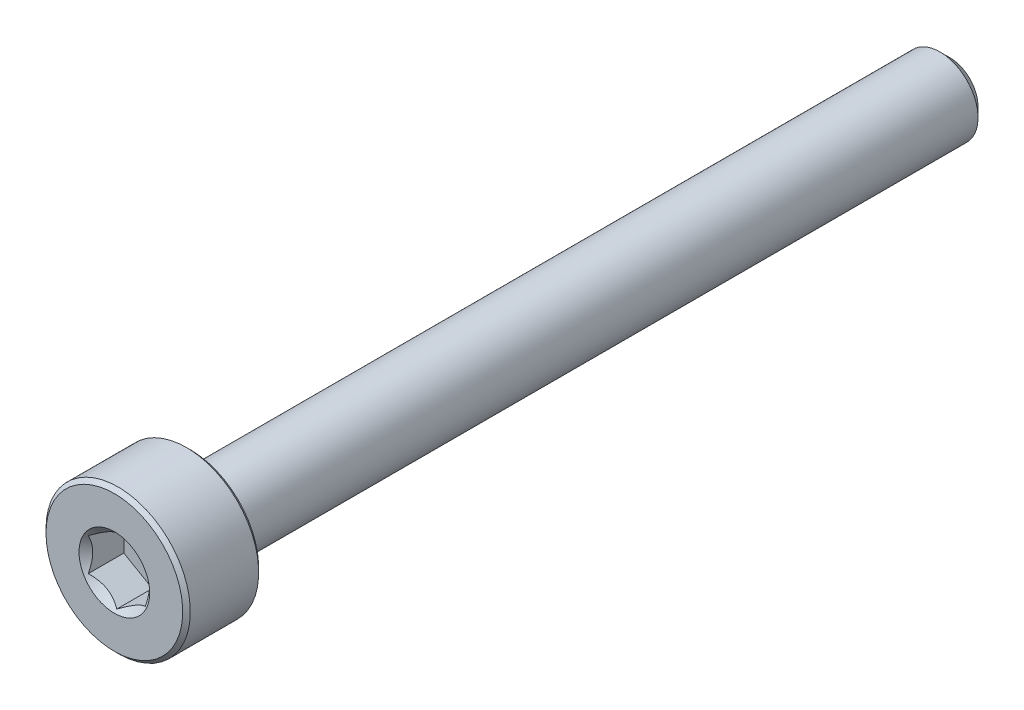
ISO-10303-21;
HEADER;
FILE_DESCRIPTION(('STEP AP214'),'2;1');
FILE_NAME('part.step','',(''),(''),'','','');
FILE_SCHEMA(('AUTOMOTIVE_DESIGN { 1 0 10303 214 1 1 1 1 }'));
ENDSEC;
DATA;
#1=APPLICATION_CONTEXT('core data for automotive mechanical design processes');
#2=APPLICATION_PROTOCOL_DEFINITION('international standard','automotive_design',2000,#1);
#3=PRODUCT_CONTEXT('',#1,'mechanical');
#4=PRODUCT('Part','Part','',(#3));
#5=PRODUCT_RELATED_PRODUCT_CATEGORY('part','',(#4));
#6=PRODUCT_DEFINITION_FORMATION('','',#4);
#7=PRODUCT_DEFINITION_CONTEXT('part definition',#1,'design');
#8=PRODUCT_DEFINITION('design','',#6,#7);
#9=PRODUCT_DEFINITION_SHAPE('','',#8);
#10=(LENGTH_UNIT() NAMED_UNIT(*) SI_UNIT(.MILLI.,.METRE.));
#11=(NAMED_UNIT(*) PLANE_ANGLE_UNIT() SI_UNIT($,.RADIAN.));
#12=(NAMED_UNIT(*) SI_UNIT($,.STERADIAN.) SOLID_ANGLE_UNIT());
#13=UNCERTAINTY_MEASURE_WITH_UNIT(LENGTH_MEASURE(1.E-05),#10,'distance_accuracy_value','');
#14=(GEOMETRIC_REPRESENTATION_CONTEXT(3) GLOBAL_UNCERTAINTY_ASSIGNED_CONTEXT((#13)) GLOBAL_UNIT_ASSIGNED_CONTEXT((#10,
#11,#12)) REPRESENTATION_CONTEXT('',''));
#15=CARTESIAN_POINT('',(0.,0.,0.));
#16=DIRECTION('',(0.,0.,1.));
#17=DIRECTION('',(1.,0.,0.));
#18=AXIS2_PLACEMENT_3D('',#15,#16,#17);
#19=CARTESIAN_POINT('',(0.,0.740192378864677,-11.));
#20=DIRECTION('',(0.,0.,-1.));
#21=DIRECTION('',(-1.,0.,0.));
#22=AXIS2_PLACEMENT_3D('',#19,#20,#21);
#23=PLANE('',#22);
#24=CARTESIAN_POINT('',(0.,0.,-11.));
#25=DIRECTION('',(0.,0.,-1.));
#26=DIRECTION('',(-1.,0.,0.));
#27=AXIS2_PLACEMENT_3D('',#24,#25,#26);
#28=CIRCLE('',#27,0.740192378864677);
#29=CARTESIAN_POINT('',(-0.740192378864677,0.,-11.));
#30=VERTEX_POINT('',#29);
#31=EDGE_CURVE('E57',#30,#30,#28,.T.);
#32=ORIENTED_EDGE('',*,*,#31,.T.);
#33=EDGE_LOOP('',(#32));
#34=FACE_BOUND('',#33,.T.);
#35=ADVANCED_FACE('F44',(#34),#23,.T.);
#36=CARTESIAN_POINT('',(0.,0.,-11.));
#37=DIRECTION('',(0.,0.,1.));
#38=DIRECTION('',(1.,0.,0.));
#39=AXIS2_PLACEMENT_3D('',#36,#37,#38);
#40=CONICAL_SURFACE('',#39,0.740192378864677,0.785398163397446);
#41=CARTESIAN_POINT('',(0.,0.,-10.7401923788647));
#42=DIRECTION('',(0.,0.,-1.));
#43=DIRECTION('',(-1.,0.,0.));
#44=AXIS2_PLACEMENT_3D('',#41,#42,#43);
#45=CIRCLE('',#44,1.);
#46=CARTESIAN_POINT('',(-1.,0.,-10.7401923788647));
#47=VERTEX_POINT('',#46);
#48=EDGE_CURVE('E160',#47,#47,#45,.T.);
#49=ORIENTED_EDGE('',*,*,#48,.T.);
#50=EDGE_LOOP('',(#49));
#51=FACE_BOUND('',#50,.T.);
#52=ORIENTED_EDGE('',*,*,#31,.F.);
#53=EDGE_LOOP('',(#52));
#54=FACE_BOUND('',#53,.T.);
#55=ADVANCED_FACE('F166',(#51,#54),#40,.T.);
#56=CARTESIAN_POINT('',(0.,0.,-11.));
#57=DIRECTION('',(0.,0.,-1.));
#58=DIRECTION('',(-1.,0.,0.));
#59=AXIS2_PLACEMENT_3D('',#56,#57,#58);
#60=CYLINDRICAL_SURFACE('',#59,1.);
#61=CARTESIAN_POINT('',(0.,0.,8.9));
#62=DIRECTION('',(0.,0.,-1.));
#63=DIRECTION('',(-1.,0.,0.));
#64=AXIS2_PLACEMENT_3D('',#61,#62,#63);
#65=CIRCLE('',#64,1.);
#66=CARTESIAN_POINT('',(-1.,0.,8.9));
#67=VERTEX_POINT('',#66);
#68=EDGE_CURVE('E157',#67,#67,#65,.T.);
#69=ORIENTED_EDGE('',*,*,#68,.T.);
#70=EDGE_LOOP('',(#69));
#71=FACE_BOUND('',#70,.T.);
#72=ORIENTED_EDGE('',*,*,#48,.F.);
#73=EDGE_LOOP('',(#72));
#74=FACE_BOUND('',#73,.T.);
#75=ADVANCED_FACE('F168',(#71,#74),#60,.T.);
#76=CARTESIAN_POINT('',(0.,0.,8.9));
#77=DIRECTION('',(0.,0.,-1.));
#78=DIRECTION('',(-1.,0.,0.));
#79=AXIS2_PLACEMENT_3D('',#76,#77,#78);
#80=TOROIDAL_SURFACE('',#79,1.1,0.0999999999999979);
#81=CARTESIAN_POINT('',(0.,0.,9.));
#82=DIRECTION('',(0.,0.,-1.));
#83=DIRECTION('',(-1.,0.,0.));
#84=AXIS2_PLACEMENT_3D('',#81,#82,#83);
#85=CIRCLE('',#84,1.1);
#86=CARTESIAN_POINT('',(-1.1,0.,9.));
#87=VERTEX_POINT('',#86);
#88=EDGE_CURVE('E154',#87,#87,#85,.T.);
#89=ORIENTED_EDGE('',*,*,#88,.T.);
#90=EDGE_LOOP('',(#89));
#91=FACE_BOUND('',#90,.T.);
#92=ORIENTED_EDGE('',*,*,#68,.F.);
#93=EDGE_LOOP('',(#92));
#94=FACE_BOUND('',#93,.T.);
#95=ADVANCED_FACE('F174',(#91,#94),#80,.F.);
#96=CARTESIAN_POINT('',(0.,1.8,9.));
#97=DIRECTION('',(0.,0.,-1.));
#98=DIRECTION('',(-1.,0.,0.));
#99=AXIS2_PLACEMENT_3D('',#96,#97,#98);
#100=PLANE('',#99);
#101=CARTESIAN_POINT('',(0.,0.,9.));
#102=DIRECTION('',(0.,0.,-1.));
#103=DIRECTION('',(-1.,0.,0.));
#104=AXIS2_PLACEMENT_3D('',#101,#102,#103);
#105=CIRCLE('',#104,1.8);
#106=CARTESIAN_POINT('',(-1.8,0.,9.));
#107=VERTEX_POINT('',#106);
#108=EDGE_CURVE('E151',#107,#107,#105,.T.);
#109=ORIENTED_EDGE('',*,*,#108,.T.);
#110=EDGE_LOOP('',(#109));
#111=FACE_BOUND('',#110,.T.);
#112=ORIENTED_EDGE('',*,*,#88,.F.);
#113=EDGE_LOOP('',(#112));
#114=FACE_BOUND('',#113,.T.);
#115=ADVANCED_FACE('F180',(#111,#114),#100,.T.);
#116=CARTESIAN_POINT('',(0.,0.,9.));
#117=DIRECTION('',(0.,0.,1.));
#118=DIRECTION('',(1.,0.,0.));
#119=AXIS2_PLACEMENT_3D('',#116,#117,#118);
#120=CONICAL_SURFACE('',#119,1.8,0.785398163397452);
#121=CARTESIAN_POINT('',(0.,0.,9.1));
#122=DIRECTION('',(0.,0.,-1.));
#123=DIRECTION('',(-1.,0.,0.));
#124=AXIS2_PLACEMENT_3D('',#121,#122,#123);
#125=CIRCLE('',#124,1.9);
#126=CARTESIAN_POINT('',(-1.9,0.,9.1));
#127=VERTEX_POINT('',#126);
#128=EDGE_CURVE('E148',#127,#127,#125,.T.);
#129=ORIENTED_EDGE('',*,*,#128,.T.);
#130=EDGE_LOOP('',(#129));
#131=FACE_BOUND('',#130,.T.);
#132=ORIENTED_EDGE('',*,*,#108,.F.);
#133=EDGE_LOOP('',(#132));
#134=FACE_BOUND('',#133,.T.);
#135=ADVANCED_FACE('F184',(#131,#134),#120,.T.);
#136=CARTESIAN_POINT('',(0.,0.,-11.));
#137=DIRECTION('',(0.,0.,-1.));
#138=DIRECTION('',(-1.,0.,0.));
#139=AXIS2_PLACEMENT_3D('',#136,#137,#138);
#140=CYLINDRICAL_SURFACE('',#139,1.9);
#141=CARTESIAN_POINT('',(0.,0.,10.9));
#142=DIRECTION('',(0.,0.,-1.));
#143=DIRECTION('',(-1.,0.,0.));
#144=AXIS2_PLACEMENT_3D('',#141,#142,#143);
#145=CIRCLE('',#144,1.9);
#146=CARTESIAN_POINT('',(-1.9,0.,10.9));
#147=VERTEX_POINT('',#146);
#148=EDGE_CURVE('E145',#147,#147,#145,.T.);
#149=ORIENTED_EDGE('',*,*,#148,.T.);
#150=EDGE_LOOP('',(#149));
#151=FACE_BOUND('',#150,.T.);
#152=ORIENTED_EDGE('',*,*,#128,.F.);
#153=EDGE_LOOP('',(#152));
#154=FACE_BOUND('',#153,.T.);
#155=ADVANCED_FACE('F188',(#151,#154),#140,.T.);
#156=CARTESIAN_POINT('',(0.,0.,10.9));
#157=DIRECTION('',(0.,0.,-1.));
#158=DIRECTION('',(-1.,0.,0.));
#159=AXIS2_PLACEMENT_3D('',#156,#157,#158);
#160=CONICAL_SURFACE('',#159,1.9,0.785398163397452);
#161=CARTESIAN_POINT('',(0.,0.,11.));
#162=DIRECTION('',(0.,0.,-1.));
#163=DIRECTION('',(-1.,0.,0.));
#164=AXIS2_PLACEMENT_3D('',#161,#162,#163);
#165=CIRCLE('',#164,1.8);
#166=CARTESIAN_POINT('',(-1.8,0.,11.));
#167=VERTEX_POINT('',#166);
#168=EDGE_CURVE('E142',#167,#167,#165,.T.);
#169=ORIENTED_EDGE('',*,*,#168,.T.);
#170=EDGE_LOOP('',(#169));
#171=FACE_BOUND('',#170,.T.);
#172=ORIENTED_EDGE('',*,*,#148,.F.);
#173=EDGE_LOOP('',(#172));
#174=FACE_BOUND('',#173,.T.);
#175=ADVANCED_FACE('F192',(#171,#174),#160,.T.);
#176=CARTESIAN_POINT('',(0.,0.,11.));
#177=DIRECTION('',(0.,0.,1.));
#178=DIRECTION('',(1.,0.,0.));
#179=AXIS2_PLACEMENT_3D('',#176,#177,#178);
#180=PLANE('',#179);
#181=CARTESIAN_POINT('',(0.,0.,11.));
#182=DIRECTION('',(0.,0.,1.));
#183=DIRECTION('',(1.,0.,0.));
#184=AXIS2_PLACEMENT_3D('',#181,#182,#183);
#185=CIRCLE('',#184,0.930977309068267);
#186=CARTESIAN_POINT('',(0.930977309068267,0.,11.));
#187=VERTEX_POINT('',#186);
#188=EDGE_CURVE('E116',#187,#187,#185,.T.);
#189=ORIENTED_EDGE('',*,*,#188,.F.);
#190=EDGE_LOOP('',(#189));
#191=FACE_BOUND('',#190,.T.);
#192=ORIENTED_EDGE('',*,*,#168,.F.);
#193=EDGE_LOOP('',(#192));
#194=FACE_BOUND('',#193,.T.);
#195=ADVANCED_FACE('F196',(#191,#194),#180,.T.);
#196=CARTESIAN_POINT('',(0.,0.,11.));
#197=DIRECTION('',(0.,0.,1.));
#198=DIRECTION('',(1.,0.,0.));
#199=AXIS2_PLACEMENT_3D('',#196,#197,#198);
#200=CONICAL_SURFACE('',#199,0.930977309068267,0.78539816339745);
#201=ORIENTED_EDGE('',*,*,#188,.T.);
#202=EDGE_LOOP('',(#201));
#203=FACE_BOUND('',#202,.T.);
#204=CARTESIAN_POINT('',(-0.000200000000000882,-0.86614087383827,10.9351635878609));
#205=CARTESIAN_POINT('',(0.0255899625576808,-0.851251032013202,10.9202822051801));
#206=CARTESIAN_POINT('',(0.0518112021286585,-0.836112192288413,10.9062743603231));
#207=CARTESIAN_POINT('',(0.105279708235705,-0.805242135894342,10.8806256193984));
#208=CARTESIAN_POINT('',(0.132532067460572,-0.789507978959813,10.8689990064218));
#209=CARTESIAN_POINT('',(0.187485350381352,-0.757780686272647,10.8490821404884));
#210=CARTESIAN_POINT('',(0.215172256695508,-0.741795643459141,10.8407417887975));
#211=CARTESIAN_POINT('',(0.271155595130851,-0.709473647943362,10.8278908366776));
#212=CARTESIAN_POINT('',(0.299450314843643,-0.693137683900537,10.823370635305));
#213=CARTESIAN_POINT('',(0.348210289268841,-0.664986099540469,10.8192939278136));
#214=CARTESIAN_POINT('',(0.36861206565557,-0.653207128451645,10.8186908913302));
#215=CARTESIAN_POINT('',(0.409376134696357,-0.629671982217682,10.8197026007317));
#216=CARTESIAN_POINT('',(0.429738417651452,-0.617915812672242,10.8213178357062));
#217=CARTESIAN_POINT('',(0.49053454308682,-0.582815153286446,10.8293842416892));
#218=CARTESIAN_POINT('',(0.530665854996096,-0.559645329552693,10.8390570305439));
#219=CARTESIAN_POINT('',(0.601110400354023,-0.518974152327353,10.8624044126885));
#220=CARTESIAN_POINT('',(0.631753572009084,-0.50128230892348,10.8748566527884));
#221=CARTESIAN_POINT('',(0.691839345804789,-0.466591771248063,10.902907704947));
#222=CARTESIAN_POINT('',(0.72128548838159,-0.44959103290475,10.9184962806199));
#223=CARTESIAN_POINT('',(0.7502,-0.432897231838375,10.9351635878609));
#224=B_SPLINE_CURVE_WITH_KNOTS('',3,(#204,#205,#206,#207,#208,#209,#210,#211,#212,#213,#214,
#215,#216,#217,#218,#219,#220,#221,#222,#223),.UNSPECIFIED.,.F.,.F.,(4,2,2,2,2,2,2,2,2,4),(0.,
0.0999419466095594,0.200466857654445,0.299393763705716,0.398071297300228,0.468665775681745,
0.539275821398836,0.680536257244562,0.792918418368073,0.904939568716033),.UNSPECIFIED.);
#225=CARTESIAN_POINT('',(0.,-0.866025403784432,10.9350480947162));
#226=VERTEX_POINT('',#225);
#227=CARTESIAN_POINT('',(0.75,-0.433012701892213,10.9350480947162));
#228=VERTEX_POINT('',#227);
#229=EDGE_CURVE('E12',#226,#228,#224,.T.);
#230=ORIENTED_EDGE('',*,*,#229,.F.);
#231=CARTESIAN_POINT('',(-0.750199999999995,-0.43289723183838,10.9351635878609));
#232=CARTESIAN_POINT('',(-0.724410037442314,-0.447787073663448,10.9202822051801));
#233=CARTESIAN_POINT('',(-0.698188797871337,-0.462925913388237,10.9062743603231));
#234=CARTESIAN_POINT('',(-0.64472029176429,-0.493795969782308,10.8806256193984));
#235=CARTESIAN_POINT('',(-0.617467932539424,-0.509530126716837,10.8689990064218));
#236=CARTESIAN_POINT('',(-0.562514649618644,-0.541257419404002,10.8490821404884));
#237=CARTESIAN_POINT('',(-0.534827743304487,-0.557242462217508,10.8407417887975));
#238=CARTESIAN_POINT('',(-0.478844404869144,-0.589564457733288,10.8278908366776));
#239=CARTESIAN_POINT('',(-0.450549685156352,-0.605900421776113,10.823370635305));
#240=CARTESIAN_POINT('',(-0.401789710731154,-0.63405200613618,10.8192939278136));
#241=CARTESIAN_POINT('',(-0.381387934344425,-0.645830977225005,10.8186908913302));
#242=CARTESIAN_POINT('',(-0.340623865303637,-0.669366123458968,10.8197026007317));
#243=CARTESIAN_POINT('',(-0.320261582348543,-0.681122293004407,10.8213178357062));
#244=CARTESIAN_POINT('',(-0.259465456913174,-0.716222952390203,10.8293842416892));
#245=CARTESIAN_POINT('',(-0.219334145003899,-0.739392776123956,10.8390570305439));
#246=CARTESIAN_POINT('',(-0.148889599645973,-0.780063953349295,10.8624044126885));
#247=CARTESIAN_POINT('',(-0.118246427990913,-0.797755796753168,10.8748566527884));
#248=CARTESIAN_POINT('',(-0.0581606541952103,-0.832446334428584,10.902907704947));
#249=CARTESIAN_POINT('',(-0.0287145116184099,-0.849447072771895,10.9184962806199));
#250=CARTESIAN_POINT('',(0.000199999999998724,-0.86614087383827,10.9351635878609));
#251=B_SPLINE_CURVE_WITH_KNOTS('',3,(#231,#232,#233,#234,#235,#236,#237,#238,#239,#240,#241,
#242,#243,#244,#245,#246,#247,#248,#249,#250),.UNSPECIFIED.,.F.,.F.,(4,2,2,2,2,2,2,2,2,4),(0.,
0.0999419466095585,0.200466857654445,0.299393763705715,0.398071297300228,0.468665775681745,
0.539275821398836,0.680536257244562,0.792918418368068,0.904939568716024),.UNSPECIFIED.);
#252=CARTESIAN_POINT('',(-0.749999999999995,-0.433012701892218,10.9350480947162));
#253=VERTEX_POINT('',#252);
#254=EDGE_CURVE('E102',#253,#226,#251,.T.);
#255=ORIENTED_EDGE('',*,*,#254,.F.);
#256=CARTESIAN_POINT('',(-0.749999999999995,-0.9089931584245,11.2474829414547));
#257=CARTESIAN_POINT('',(-0.749999999999995,-0.887052399965032,11.2305616523291));
#258=CARTESIAN_POINT('',(-0.749999999999995,-0.86499445254444,11.2137927714218));
#259=CARTESIAN_POINT('',(-0.749999999999995,-0.820595091161565,11.180624057915));
#260=CARTESIAN_POINT('',(-0.749999999999995,-0.798253612413865,11.1642243121246));
#261=CARTESIAN_POINT('',(-0.749999999999995,-0.73040351594495,11.1154409498094));
#262=CARTESIAN_POINT('',(-0.749999999999995,-0.68440148609021,11.0837326305615));
#263=CARTESIAN_POINT('',(-0.749999999999995,-0.587630943752085,11.0210512707378));
#264=CARTESIAN_POINT('',(-0.749999999999995,-0.536746006676903,10.9902560400654));
#265=CARTESIAN_POINT('',(-0.749999999999995,-0.43238337645402,10.9336257718331));
#266=CARTESIAN_POINT('',(-0.749999999999995,-0.378915238071277,10.9077739815374));
#267=CARTESIAN_POINT('',(-0.749999999999996,-0.299071429351743,10.876137143555));
#268=CARTESIAN_POINT('',(-0.749999999999996,-0.273980510808171,10.8671385892067));
#269=CARTESIAN_POINT('',(-0.749999999999996,-0.223167896807673,10.8511461852722));
#270=CARTESIAN_POINT('',(-0.749999999999996,-0.197446161667869,10.8441524621572));
#271=CARTESIAN_POINT('',(-0.749999999999996,-0.120459338268896,10.8270275033935));
#272=CARTESIAN_POINT('',(-0.749999999999996,-0.0683464355179096,10.8203161345352));
#273=CARTESIAN_POINT('',(-0.749999999999996,0.0337920589257214,10.8181253211917));
#274=CARTESIAN_POINT('',(-0.749999999999996,0.0838066628456617,10.8221565412005));
#275=CARTESIAN_POINT('',(-0.749999999999996,0.157981834018414,10.835074885811));
#276=CARTESIAN_POINT('',(-0.749999999999996,0.182796003556083,10.8406123005046));
#277=CARTESIAN_POINT('',(-0.749999999999996,0.231887166565739,10.853698524901));
#278=CARTESIAN_POINT('',(-0.749999999999996,0.256164188491815,10.8612472277831));
#279=CARTESIAN_POINT('',(-0.749999999999996,0.330659225549256,10.8873056029569));
#280=CARTESIAN_POINT('',(-0.749999999999996,0.379861121085843,10.9087021269934));
#281=CARTESIAN_POINT('',(-0.749999999999996,0.475970605705222,10.9563197744089));
#282=CARTESIAN_POINT('',(-0.749999999999996,0.522869373813369,10.98255785461));
#283=CARTESIAN_POINT('',(-0.749999999999996,0.612520945812658,11.0367390817918));
#284=CARTESIAN_POINT('',(-0.749999999999996,0.655364174071619,11.0645345354766));
#285=CARTESIAN_POINT('',(-0.749999999999997,0.718484766813281,11.1075252259075));
#286=CARTESIAN_POINT('',(-0.749999999999997,0.739253587078311,11.1220113238788));
#287=CARTESIAN_POINT('',(-0.749999999999997,0.780506229689749,11.1513724151974));
#288=CARTESIAN_POINT('',(-0.749999999999997,0.800990128619761,11.1662473008223));
#289=CARTESIAN_POINT('',(-0.749999999999997,0.821355148585424,11.181283577643));
#290=B_SPLINE_CURVE_WITH_KNOTS('',3,(#256,#257,#258,#259,#260,#261,#262,#263,#264,#265,#266,
#267,#268,#269,#270,#271,#272,#273,#274,#275,#276,#277,#278,#279,#280,#281,#282,#283,#284,#285,
#286,#287,#288,#289),.UNSPECIFIED.,.F.,.F.,(4,2,2,2,2,2,2,2,2,2,2,2,2,2,2,2,4),(0.,
0.0831217081502298,0.166262763947898,0.333808791437732,0.512108301465775,0.689792429955632,
0.769685928013999,0.849584464902761,1.00608040173681,1.15557098404965,1.23177009418091,
1.30796515813853,1.46846030983728,1.62952862501053,1.78266144768383,1.85862369010575,
1.93456510404421),.UNSPECIFIED.);
#291=CARTESIAN_POINT('',(-0.749999999999996,0.433012701892216,10.9350480947162));
#292=VERTEX_POINT('',#291);
#293=EDGE_CURVE('E115',#292,#253,#290,.F.);
#294=ORIENTED_EDGE('',*,*,#293,.F.);
#295=CARTESIAN_POINT('',(0.000199999999999783,0.866140873838272,10.9351635878609));
#296=CARTESIAN_POINT('',(-0.0255899625576815,0.851251032013204,10.9202822051801));
#297=CARTESIAN_POINT('',(-0.0518112021286589,0.836112192288415,10.9062743603231));
#298=CARTESIAN_POINT('',(-0.105279708235706,0.805242135894344,10.8806256193984));
#299=CARTESIAN_POINT('',(-0.132532067460573,0.789507978959815,10.8689990064218));
#300=CARTESIAN_POINT('',(-0.187485350381353,0.757780686272649,10.8490821404884));
#301=CARTESIAN_POINT('',(-0.215172256695509,0.741795643459143,10.8407417887975));
#302=CARTESIAN_POINT('',(-0.271155595130853,0.709473647943363,10.8278908366776));
#303=CARTESIAN_POINT('',(-0.299450314843644,0.693137683900538,10.823370635305));
#304=CARTESIAN_POINT('',(-0.348210289268843,0.66498609954047,10.8192939278136));
#305=CARTESIAN_POINT('',(-0.368612065655572,0.653207128451646,10.8186908913302));
#306=CARTESIAN_POINT('',(-0.409376134696359,0.629671982217683,10.8197026007317));
#307=CARTESIAN_POINT('',(-0.429738417651454,0.617915812672243,10.8213178357062));
#308=CARTESIAN_POINT('',(-0.490534543086822,0.582815153286447,10.8293842416892));
#309=CARTESIAN_POINT('',(-0.530665854996097,0.559645329552694,10.8390570305439));
#310=CARTESIAN_POINT('',(-0.601110400354023,0.518974152327355,10.8624044126885));
#311=CARTESIAN_POINT('',(-0.631753572009084,0.501282308923482,10.8748566527884));
#312=CARTESIAN_POINT('',(-0.691839345804786,0.466591771248066,10.902907704947));
#313=CARTESIAN_POINT('',(-0.721285488381587,0.449591032904754,10.9184962806199));
#314=CARTESIAN_POINT('',(-0.750199999999996,0.432897231838379,10.9351635878609));
#315=B_SPLINE_CURVE_WITH_KNOTS('',3,(#295,#296,#297,#298,#299,#300,#301,#302,#303,#304,#305,
#306,#307,#308,#309,#310,#311,#312,#313,#314),.UNSPECIFIED.,.F.,.F.,(4,2,2,2,2,2,2,2,2,4),(0.,
0.0999419466095584,0.200466857654446,0.299393763705716,0.398071297300229,0.468665775681746,
0.539275821398838,0.680536257244564,0.792918418368069,0.904939568716026),.UNSPECIFIED.);
#316=CARTESIAN_POINT('',(0.,0.866025403784434,10.9350480947162));
#317=VERTEX_POINT('',#316);
#318=EDGE_CURVE('E246',#317,#292,#315,.T.);
#319=ORIENTED_EDGE('',*,*,#318,.F.);
#320=CARTESIAN_POINT('',(0.7502,0.432897231838378,10.9351635878609));
#321=CARTESIAN_POINT('',(0.724410037442319,0.447787073663446,10.9202822051801));
#322=CARTESIAN_POINT('',(0.698188797871341,0.462925913388236,10.9062743603231));
#323=CARTESIAN_POINT('',(0.644720291764293,0.493795969782307,10.8806256193984));
#324=CARTESIAN_POINT('',(0.617467932539426,0.509530126716836,10.8689990064218));
#325=CARTESIAN_POINT('',(0.562514649618645,0.541257419404002,10.8490821404884));
#326=CARTESIAN_POINT('',(0.534827743304488,0.557242462217509,10.8407417887975));
#327=CARTESIAN_POINT('',(0.478844404869144,0.589564457733288,10.8278908366776));
#328=CARTESIAN_POINT('',(0.450549685156352,0.605900421776114,10.823370635305));
#329=CARTESIAN_POINT('',(0.401789710731153,0.634052006136182,10.8192939278136));
#330=CARTESIAN_POINT('',(0.381387934344424,0.645830977225006,10.8186908913302));
#331=CARTESIAN_POINT('',(0.340623865303637,0.669366123458969,10.8197026007317));
#332=CARTESIAN_POINT('',(0.320261582348542,0.681122293004409,10.8213178357062));
#333=CARTESIAN_POINT('',(0.259465456913173,0.716222952390205,10.8293842416892));
#334=CARTESIAN_POINT('',(0.219334145003898,0.739392776123958,10.8390570305439));
#335=CARTESIAN_POINT('',(0.148889599645972,0.780063953349297,10.8624044126885));
#336=CARTESIAN_POINT('',(0.118246427990912,0.79775579675317,10.8748566527884));
#337=CARTESIAN_POINT('',(0.0581606541952098,0.832446334428585,10.902907704947));
#338=CARTESIAN_POINT('',(0.0287145116184092,0.849447072771897,10.9184962806199));
#339=CARTESIAN_POINT('',(-0.000199999999999814,0.866140873838272,10.9351635878609));
#340=B_SPLINE_CURVE_WITH_KNOTS('',3,(#320,#321,#322,#323,#324,#325,#326,#327,#328,#329,#330,
#331,#332,#333,#334,#335,#336,#337,#338,#339),.UNSPECIFIED.,.F.,.F.,(4,2,2,2,2,2,2,2,2,4),(0.,
0.0999419466095603,0.200466857654448,0.299393763705721,0.398071297300234,0.468665775681752,
0.539275821398843,0.68053625724457,0.792918418368075,0.904939568716031),.UNSPECIFIED.);
#341=CARTESIAN_POINT('',(0.75,0.433012701892216,10.9350480947162));
#342=VERTEX_POINT('',#341);
#343=EDGE_CURVE('E219',#342,#317,#340,.T.);
#344=ORIENTED_EDGE('',*,*,#343,.F.);
#345=CARTESIAN_POINT('',(0.75,-0.90899315842449,11.2474829414546));
#346=CARTESIAN_POINT('',(0.75,-0.887052399965022,11.2305616523291));
#347=CARTESIAN_POINT('',(0.75,-0.864994452544429,11.2137927714218));
#348=CARTESIAN_POINT('',(0.75,-0.820595091161555,11.1806240579149));
#349=CARTESIAN_POINT('',(0.75,-0.798253612413855,11.1642243121246));
#350=CARTESIAN_POINT('',(0.75,-0.730403515944941,11.1154409498094));
#351=CARTESIAN_POINT('',(0.75,-0.684401486090201,11.0837326305615));
#352=CARTESIAN_POINT('',(0.75,-0.587630943752077,11.0210512707378));
#353=CARTESIAN_POINT('',(0.75,-0.536746006676895,10.9902560400654));
#354=CARTESIAN_POINT('',(0.75,-0.432383376454014,10.9336257718331));
#355=CARTESIAN_POINT('',(0.75,-0.378915238071271,10.9077739815374));
#356=CARTESIAN_POINT('',(0.75,-0.299071429351738,10.876137143555));
#357=CARTESIAN_POINT('',(0.75,-0.273980510808165,10.8671385892067));
#358=CARTESIAN_POINT('',(0.75,-0.223167896807668,10.8511461852722));
#359=CARTESIAN_POINT('',(0.75,-0.197446161667864,10.8441524621572));
#360=CARTESIAN_POINT('',(0.75,-0.12045933826889,10.8270275033935));
#361=CARTESIAN_POINT('',(0.75,-0.0683464355179046,10.8203161345352));
#362=CARTESIAN_POINT('',(0.75,0.0337920589257259,10.8181253211917));
#363=CARTESIAN_POINT('',(0.75,0.0838066628456657,10.8221565412005));
#364=CARTESIAN_POINT('',(0.75,0.157981834018418,10.835074885811));
#365=CARTESIAN_POINT('',(0.75,0.182796003556087,10.8406123005046));
#366=CARTESIAN_POINT('',(0.75,0.231887166565743,10.853698524901));
#367=CARTESIAN_POINT('',(0.75,0.256164188491818,10.8612472277831));
#368=CARTESIAN_POINT('',(0.75,0.33065922554926,10.8873056029569));
#369=CARTESIAN_POINT('',(0.75,0.379861121085847,10.9087021269934));
#370=CARTESIAN_POINT('',(0.75,0.475970605705227,10.9563197744089));
#371=CARTESIAN_POINT('',(0.75,0.522869373813374,10.98255785461));
#372=CARTESIAN_POINT('',(0.75,0.612520945812664,11.0367390817918));
#373=CARTESIAN_POINT('',(0.75,0.655364174071626,11.0645345354766));
#374=CARTESIAN_POINT('',(0.75,0.718484766813289,11.1075252259075));
#375=CARTESIAN_POINT('',(0.75,0.739253587078319,11.1220113238788));
#376=CARTESIAN_POINT('',(0.75,0.780506229689758,11.1513724151974));
#377=CARTESIAN_POINT('',(0.75,0.800990128619769,11.1662473008223));
#378=CARTESIAN_POINT('',(0.75,0.821355148585433,11.181283577643));
#379=B_SPLINE_CURVE_WITH_KNOTS('',3,(#345,#346,#347,#348,#349,#350,#351,#352,#353,#354,#355,
#356,#357,#358,#359,#360,#361,#362,#363,#364,#365,#366,#367,#368,#369,#370,#371,#372,#373,#374,
#375,#376,#377,#378),.UNSPECIFIED.,.F.,.F.,(4,2,2,2,2,2,2,2,2,2,2,2,2,2,2,2,4),(0.,
0.0831217081502296,0.166262763947896,0.333808791437728,0.512108301465769,0.689792429955624,
0.769685928013991,0.849584464902753,1.0060804017368,1.15557098404963,1.2317700941809,
1.30796515813852,1.46846030983727,1.62952862501053,1.78266144768382,1.85862369010574,
1.93456510404421),.UNSPECIFIED.);
#380=EDGE_CURVE('E64',#228,#342,#379,.T.);
#381=ORIENTED_EDGE('',*,*,#380,.F.);
#382=EDGE_LOOP('',(#230,#255,#294,#319,#344,#381));
#383=FACE_BOUND('',#382,.T.);
#384=ADVANCED_FACE('F101',(#203,#383),#200,.F.);
#385=CARTESIAN_POINT('',(0.,1.8,10.));
#386=DIRECTION('',(0.,0.,-1.));
#387=DIRECTION('',(-1.,0.,0.));
#388=AXIS2_PLACEMENT_3D('',#385,#386,#387);
#389=PLANE('',#388);
#390=DIRECTION('',(0.866025403784439,0.5,0.));
#391=VECTOR('',#390,1.);
#392=CARTESIAN_POINT('',(0.,-0.866025403784432,10.));
#393=LINE('',#392,#391);
#394=CARTESIAN_POINT('',(0.,-0.866025403784432,10.));
#395=VERTEX_POINT('',#394);
#396=CARTESIAN_POINT('',(0.75,-0.433012701892213,10.));
#397=VERTEX_POINT('',#396);
#398=EDGE_CURVE('E119',#395,#397,#393,.T.);
#399=ORIENTED_EDGE('',*,*,#398,.T.);
#400=DIRECTION('',(0.,1.,0.));
#401=VECTOR('',#400,1.);
#402=CARTESIAN_POINT('',(0.75,-0.433012701892213,10.));
#403=LINE('',#402,#401);
#404=CARTESIAN_POINT('',(0.75,0.433012701892216,10.));
#405=VERTEX_POINT('',#404);
#406=EDGE_CURVE('E71',#397,#405,#403,.T.);
#407=ORIENTED_EDGE('',*,*,#406,.T.);
#408=DIRECTION('',(-0.866025403784439,0.499999999999999,0.));
#409=VECTOR('',#408,1.);
#410=CARTESIAN_POINT('',(0.75,0.433012701892216,10.));
#411=LINE('',#410,#409);
#412=CARTESIAN_POINT('',(0.,0.866025403784434,10.));
#413=VERTEX_POINT('',#412);
#414=EDGE_CURVE('E127',#405,#413,#411,.T.);
#415=ORIENTED_EDGE('',*,*,#414,.T.);
#416=DIRECTION('',(-0.866025403784438,-0.5,0.));
#417=VECTOR('',#416,1.);
#418=CARTESIAN_POINT('',(0.,0.866025403784434,10.));
#419=LINE('',#418,#417);
#420=CARTESIAN_POINT('',(-0.749999999999996,0.433012701892217,10.));
#421=VERTEX_POINT('',#420);
#422=EDGE_CURVE('E134',#413,#421,#419,.T.);
#423=ORIENTED_EDGE('',*,*,#422,.T.);
#424=DIRECTION('',(0.,-1.,0.));
#425=VECTOR('',#424,1.);
#426=CARTESIAN_POINT('',(-0.749999999999996,0.433012701892217,10.));
#427=LINE('',#426,#425);
#428=CARTESIAN_POINT('',(-0.749999999999995,-0.433012701892218,10.));
#429=VERTEX_POINT('',#428);
#430=EDGE_CURVE('E130',#421,#429,#427,.T.);
#431=ORIENTED_EDGE('',*,*,#430,.T.);
#432=DIRECTION('',(0.86602540378444,-0.499999999999999,0.));
#433=VECTOR('',#432,1.);
#434=CARTESIAN_POINT('',(-0.749999999999995,-0.433012701892218,10.));
#435=LINE('',#434,#433);
#436=EDGE_CURVE('E120',#429,#395,#435,.T.);
#437=ORIENTED_EDGE('',*,*,#436,.T.);
#438=EDGE_LOOP('',(#399,#407,#415,#423,#431,#437));
#439=FACE_BOUND('',#438,.T.);
#440=ADVANCED_FACE('F201',(#439),#389,.F.);
#441=CARTESIAN_POINT('',(0.,-0.866025403784432,6.70871215252209));
#442=DIRECTION('',(0.5,-0.866025403784439,0.));
#443=DIRECTION('',(0.866025403784439,0.5,0.));
#444=AXIS2_PLACEMENT_3D('',#441,#442,#443);
#445=PLANE('',#444);
#446=DIRECTION('',(0.,0.,1.));
#447=VECTOR('',#446,1.);
#448=CARTESIAN_POINT('',(0.,-0.866025403784432,6.70871215252209));
#449=LINE('',#448,#447);
#450=EDGE_CURVE('E111',#395,#226,#449,.T.);
#451=ORIENTED_EDGE('',*,*,#450,.T.);
#452=ORIENTED_EDGE('',*,*,#229,.T.);
#453=DIRECTION('',(0.,0.,1.));
#454=VECTOR('',#453,1.);
#455=CARTESIAN_POINT('',(0.75,-0.433012701892213,6.70871215252209));
#456=LINE('',#455,#454);
#457=EDGE_CURVE('E122',#397,#228,#456,.T.);
#458=ORIENTED_EDGE('',*,*,#457,.F.);
#459=ORIENTED_EDGE('',*,*,#398,.F.);
#460=EDGE_LOOP('',(#451,#452,#458,#459));
#461=FACE_BOUND('',#460,.T.);
#462=ADVANCED_FACE('F118',(#461),#445,.F.);
#463=CARTESIAN_POINT('',(-0.749999999999995,-0.433012701892218,6.70871215252209));
#464=DIRECTION('',(-0.499999999999999,-0.866025403784439,0.));
#465=DIRECTION('',(0.86602540378444,-0.499999999999999,0.));
#466=AXIS2_PLACEMENT_3D('',#463,#464,#465);
#467=PLANE('',#466);
#468=DIRECTION('',(0.,0.,1.));
#469=VECTOR('',#468,1.);
#470=CARTESIAN_POINT('',(-0.749999999999995,-0.433012701892218,6.70871215252209));
#471=LINE('',#470,#469);
#472=EDGE_CURVE('E114',#429,#253,#471,.T.);
#473=ORIENTED_EDGE('',*,*,#472,.T.);
#474=ORIENTED_EDGE('',*,*,#254,.T.);
#475=ORIENTED_EDGE('',*,*,#450,.F.);
#476=ORIENTED_EDGE('',*,*,#436,.F.);
#477=EDGE_LOOP('',(#473,#474,#475,#476));
#478=FACE_BOUND('',#477,.T.);
#479=ADVANCED_FACE('F110',(#478),#467,.F.);
#480=CARTESIAN_POINT('',(-0.749999999999996,0.433012701892217,6.70871215252209));
#481=DIRECTION('',(-1.,0.,0.));
#482=DIRECTION('',(0.,-1.,0.));
#483=AXIS2_PLACEMENT_3D('',#480,#481,#482);
#484=PLANE('',#483);
#485=DIRECTION('',(0.,0.,1.));
#486=VECTOR('',#485,1.);
#487=CARTESIAN_POINT('',(-0.749999999999996,0.433012701892217,6.70871215252209));
#488=LINE('',#487,#486);
#489=EDGE_CURVE('E131',#421,#292,#488,.T.);
#490=ORIENTED_EDGE('',*,*,#489,.T.);
#491=ORIENTED_EDGE('',*,*,#293,.T.);
#492=ORIENTED_EDGE('',*,*,#472,.F.);
#493=ORIENTED_EDGE('',*,*,#430,.F.);
#494=EDGE_LOOP('',(#490,#491,#492,#493));
#495=FACE_BOUND('',#494,.T.);
#496=ADVANCED_FACE('F255',(#495),#484,.F.);
#497=CARTESIAN_POINT('',(0.,0.866025403784434,6.70871215252209));
#498=DIRECTION('',(-0.5,0.866025403784438,0.));
#499=DIRECTION('',(-0.866025403784438,-0.5,0.));
#500=AXIS2_PLACEMENT_3D('',#497,#498,#499);
#501=PLANE('',#500);
#502=DIRECTION('',(0.,0.,1.));
#503=VECTOR('',#502,1.);
#504=CARTESIAN_POINT('',(0.,0.866025403784434,6.70871215252209));
#505=LINE('',#504,#503);
#506=EDGE_CURVE('E135',#413,#317,#505,.T.);
#507=ORIENTED_EDGE('',*,*,#506,.T.);
#508=ORIENTED_EDGE('',*,*,#318,.T.);
#509=ORIENTED_EDGE('',*,*,#489,.F.);
#510=ORIENTED_EDGE('',*,*,#422,.F.);
#511=EDGE_LOOP('',(#507,#508,#509,#510));
#512=FACE_BOUND('',#511,.T.);
#513=ADVANCED_FACE('F252',(#512),#501,.F.);
#514=CARTESIAN_POINT('',(0.75,0.433012701892216,6.70871215252209));
#515=DIRECTION('',(0.499999999999999,0.866025403784439,0.));
#516=DIRECTION('',(-0.866025403784439,0.499999999999999,0.));
#517=AXIS2_PLACEMENT_3D('',#514,#515,#516);
#518=PLANE('',#517);
#519=DIRECTION('',(0.,0.,1.));
#520=VECTOR('',#519,1.);
#521=CARTESIAN_POINT('',(0.75,0.433012701892216,6.70871215252209));
#522=LINE('',#521,#520);
#523=EDGE_CURVE('E138',#405,#342,#522,.T.);
#524=ORIENTED_EDGE('',*,*,#523,.T.);
#525=ORIENTED_EDGE('',*,*,#343,.T.);
#526=ORIENTED_EDGE('',*,*,#506,.F.);
#527=ORIENTED_EDGE('',*,*,#414,.F.);
#528=EDGE_LOOP('',(#524,#525,#526,#527));
#529=FACE_BOUND('',#528,.T.);
#530=ADVANCED_FACE('F209',(#529),#518,.F.);
#531=CARTESIAN_POINT('',(0.75,-0.433012701892213,6.70871215252209));
#532=DIRECTION('',(1.,0.,0.));
#533=DIRECTION('',(0.,0.,-1.));
#534=AXIS2_PLACEMENT_3D('',#531,#532,#533);
#535=PLANE('',#534);
#536=ORIENTED_EDGE('',*,*,#457,.T.);
#537=ORIENTED_EDGE('',*,*,#380,.T.);
#538=ORIENTED_EDGE('',*,*,#523,.F.);
#539=ORIENTED_EDGE('',*,*,#406,.F.);
#540=EDGE_LOOP('',(#536,#537,#538,#539));
#541=FACE_BOUND('',#540,.T.);
#542=ADVANCED_FACE('F205',(#541),#535,.F.);
#543=CLOSED_SHELL('',(#35,#55,#75,#95,#115,#135,#155,#175,#195,#384,#440,#462,#479,#496,#513,
#530,#542));
#544=MANIFOLD_SOLID_BREP('B2',#543);
#545=ADVANCED_BREP_SHAPE_REPRESENTATION('',(#18,#544),#14);
#546=SHAPE_DEFINITION_REPRESENTATION(#9,#545);
ENDSEC;
END-ISO-10303-21;
